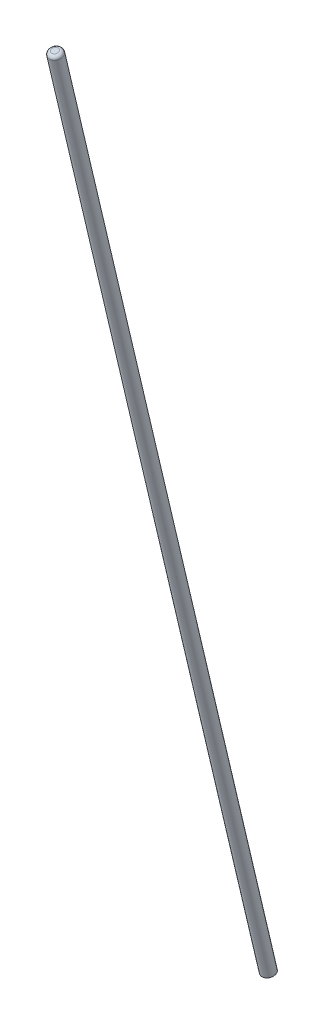
ISO-10303-21;
HEADER;
FILE_DESCRIPTION(('STEP AP214'),'2;1');
FILE_NAME('part.step','',(''),(''),'','','');
FILE_SCHEMA(('AUTOMOTIVE_DESIGN { 1 0 10303 214 1 1 1 1 }'));
ENDSEC;
DATA;
#1=APPLICATION_CONTEXT('core data for automotive mechanical design processes');
#2=APPLICATION_PROTOCOL_DEFINITION('international standard','automotive_design',2000,#1);
#3=PRODUCT_CONTEXT('',#1,'mechanical');
#4=PRODUCT('Part','Part','',(#3));
#5=PRODUCT_RELATED_PRODUCT_CATEGORY('part','',(#4));
#6=PRODUCT_DEFINITION_FORMATION('','',#4);
#7=PRODUCT_DEFINITION_CONTEXT('part definition',#1,'design');
#8=PRODUCT_DEFINITION('design','',#6,#7);
#9=PRODUCT_DEFINITION_SHAPE('','',#8);
#10=(LENGTH_UNIT() NAMED_UNIT(*) SI_UNIT(.MILLI.,.METRE.));
#11=(NAMED_UNIT(*) PLANE_ANGLE_UNIT() SI_UNIT($,.RADIAN.));
#12=(NAMED_UNIT(*) SI_UNIT($,.STERADIAN.) SOLID_ANGLE_UNIT());
#13=UNCERTAINTY_MEASURE_WITH_UNIT(LENGTH_MEASURE(1.E-05),#10,'distance_accuracy_value','');
#14=(GEOMETRIC_REPRESENTATION_CONTEXT(3) GLOBAL_UNCERTAINTY_ASSIGNED_CONTEXT((#13)) GLOBAL_UNIT_ASSIGNED_CONTEXT((#10,
#11,#12)) REPRESENTATION_CONTEXT('',''));
#15=CARTESIAN_POINT('',(0.,0.,0.));
#16=DIRECTION('',(0.,0.,1.));
#17=DIRECTION('',(1.,0.,0.));
#18=AXIS2_PLACEMENT_3D('',#15,#16,#17);
#19=CARTESIAN_POINT('',(1031.95080176923,1816.43710603682,948.534556369506));
#20=DIRECTION('',(0.00690262513401616,0.972045939018343,0.234689254556335));
#21=DIRECTION('',(0.,-0.234694845785676,0.972069097009898));
#22=AXIS2_PLACEMENT_3D('',#19,#20,#21);
#23=PLANE('',#22);
#24=CARTESIAN_POINT('',(1031.95080176923,1816.43710603682,948.534556369506));
#25=DIRECTION('',(0.00690262513401616,0.972045939018343,0.234689254556335));
#26=DIRECTION('',(0.,-0.234694845785676,0.972069097009898));
#27=AXIS2_PLACEMENT_3D('',#24,#25,#26);
#28=CIRCLE('',#27,5.07999999999999);
#29=CARTESIAN_POINT('',(1031.95080176923,1815.24485622023,953.472667382316));
#30=VERTEX_POINT('',#29);
#31=EDGE_CURVE('E63',#30,#30,#28,.T.);
#32=ORIENTED_EDGE('',*,*,#31,.F.);
#33=EDGE_LOOP('',(#32));
#34=FACE_BOUND('',#33,.T.);
#35=ADVANCED_FACE('F52',(#34),#23,.F.);
#36=CARTESIAN_POINT('',(1037.03080176923,2531.81615014617,1121.25455636951));
#37=DIRECTION('',(0.00690262513401616,0.972045939018343,0.234689254556335));
#38=DIRECTION('',(0.,-0.234694845785676,0.972069097009898));
#39=AXIS2_PLACEMENT_3D('',#36,#37,#38);
#40=PLANE('',#39);
#41=CARTESIAN_POINT('',(1037.03080176923,2531.81615014617,1121.25455636951));
#42=DIRECTION('',(0.00690262513401616,0.972045939018343,0.234689254556335));
#43=DIRECTION('',(0.,-0.234694845785676,0.972069097009898));
#44=AXIS2_PLACEMENT_3D('',#41,#42,#43);
#45=CIRCLE('',#44,2.53999999999999);
#46=CARTESIAN_POINT('',(1037.03080176923,2531.22002523788,1123.72361187591));
#47=VERTEX_POINT('',#46);
#48=EDGE_CURVE('E59',#47,#47,#45,.T.);
#49=ORIENTED_EDGE('',*,*,#48,.T.);
#50=EDGE_LOOP('',(#49));
#51=FACE_BOUND('',#50,.T.);
#52=ADVANCED_FACE('F69',(#51),#40,.T.);
#53=CARTESIAN_POINT('',(1031.95080176923,1816.43710603682,948.534556369506));
#54=DIRECTION('',(0.00690262513401706,0.972045939018342,0.234689254556335));
#55=DIRECTION('',(0.,-0.234694845785676,0.972069097009898));
#56=AXIS2_PLACEMENT_3D('',#53,#54,#55);
#57=CYLINDRICAL_SURFACE('',#56,5.07999999999999);
#58=CARTESIAN_POINT('',(1037.01326910139,2529.34715346107,1120.65844566293));
#59=DIRECTION('',(0.00690262513401616,0.972045939018343,0.234689254556335));
#60=DIRECTION('',(0.,-0.234694845785676,0.972069097009898));
#61=AXIS2_PLACEMENT_3D('',#58,#59,#60);
#62=CIRCLE('',#61,5.07999999999999);
#63=CARTESIAN_POINT('',(1037.01326910139,2528.15490364448,1125.59655667574));
#64=VERTEX_POINT('',#63);
#65=EDGE_CURVE('E14',#64,#64,#62,.F.);
#66=ORIENTED_EDGE('',*,*,#65,.T.);
#67=EDGE_LOOP('',(#66));
#68=FACE_BOUND('',#67,.T.);
#69=ORIENTED_EDGE('',*,*,#31,.T.);
#70=EDGE_LOOP('',(#69));
#71=FACE_BOUND('',#70,.T.);
#72=ADVANCED_FACE('F72',(#68,#71),#57,.T.);
#73=CARTESIAN_POINT('',(1037.01326910139,2529.34715346107,1120.65844566293));
#74=DIRECTION('',(0.00690262513401616,0.972045939018343,0.234689254556335));
#75=DIRECTION('',(0.,-0.234694845785676,0.972069097009898));
#76=AXIS2_PLACEMENT_3D('',#73,#74,#75);
#77=DEGENERATE_TOROIDAL_SURFACE('',#76,2.53999999999999,2.54,.T.);
#78=ORIENTED_EDGE('',*,*,#65,.F.);
#79=EDGE_LOOP('',(#78));
#80=FACE_BOUND('',#79,.T.);
#81=ORIENTED_EDGE('',*,*,#48,.F.);
#82=EDGE_LOOP('',(#81));
#83=FACE_BOUND('',#82,.T.);
#84=ADVANCED_FACE('F54',(#80,#83),#77,.T.);
#85=CLOSED_SHELL('',(#35,#52,#72,#84));
#86=MANIFOLD_SOLID_BREP('B2',#85);
#87=ADVANCED_BREP_SHAPE_REPRESENTATION('',(#18,#86),#14);
#88=SHAPE_DEFINITION_REPRESENTATION(#9,#87);
ENDSEC;
END-ISO-10303-21;
